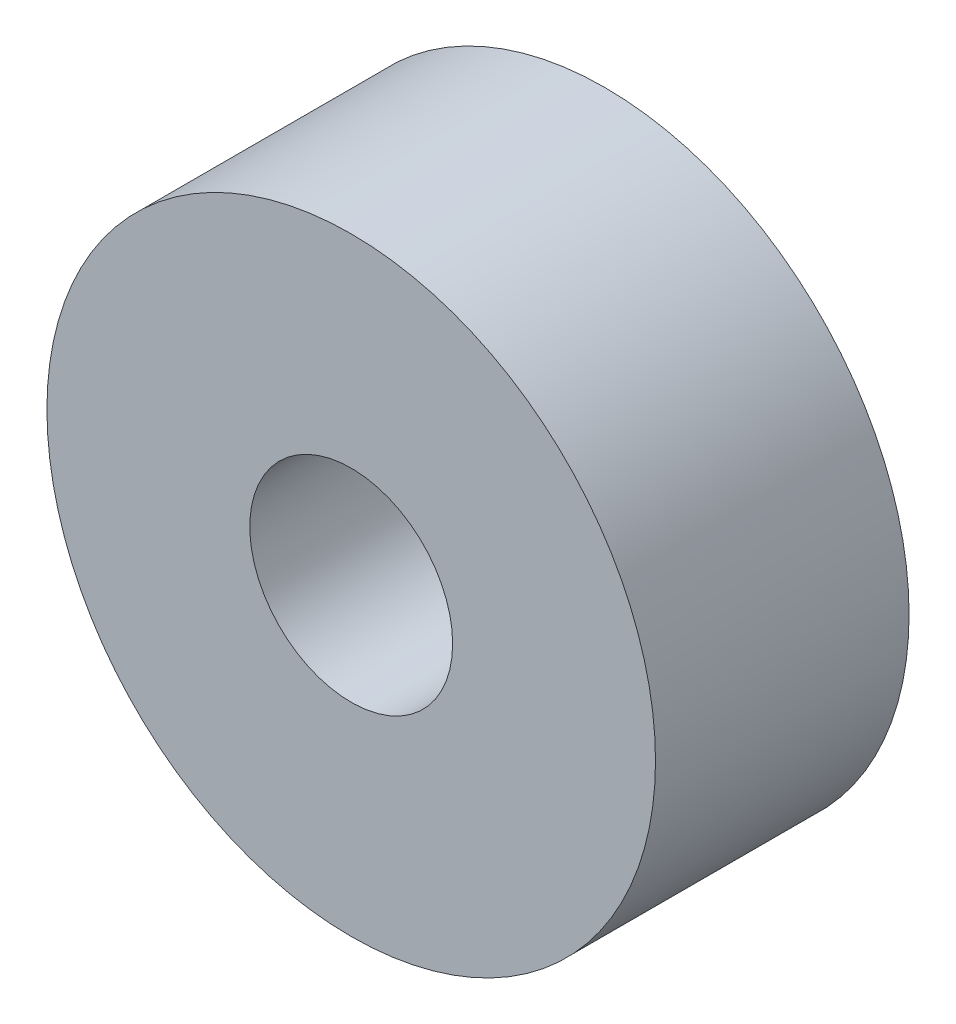
ISO-10303-21;
HEADER;
FILE_DESCRIPTION(('STEP AP214'),'2;1');
FILE_NAME('part.step','',(''),(''),'','','');
FILE_SCHEMA(('AUTOMOTIVE_DESIGN { 1 0 10303 214 1 1 1 1 }'));
ENDSEC;
DATA;
#1=APPLICATION_CONTEXT('core data for automotive mechanical design processes');
#2=APPLICATION_PROTOCOL_DEFINITION('international standard','automotive_design',2000,#1);
#3=PRODUCT_CONTEXT('',#1,'mechanical');
#4=PRODUCT('Part','Part','',(#3));
#5=PRODUCT_RELATED_PRODUCT_CATEGORY('part','',(#4));
#6=PRODUCT_DEFINITION_FORMATION('','',#4);
#7=PRODUCT_DEFINITION_CONTEXT('part definition',#1,'design');
#8=PRODUCT_DEFINITION('design','',#6,#7);
#9=PRODUCT_DEFINITION_SHAPE('','',#8);
#10=(LENGTH_UNIT() NAMED_UNIT(*) SI_UNIT(.MILLI.,.METRE.));
#11=(NAMED_UNIT(*) PLANE_ANGLE_UNIT() SI_UNIT($,.RADIAN.));
#12=(NAMED_UNIT(*) SI_UNIT($,.STERADIAN.) SOLID_ANGLE_UNIT());
#13=UNCERTAINTY_MEASURE_WITH_UNIT(LENGTH_MEASURE(1.E-05),#10,'distance_accuracy_value','');
#14=(GEOMETRIC_REPRESENTATION_CONTEXT(3) GLOBAL_UNCERTAINTY_ASSIGNED_CONTEXT((#13)) GLOBAL_UNIT_ASSIGNED_CONTEXT((#10,
#11,#12)) REPRESENTATION_CONTEXT('',''));
#15=CARTESIAN_POINT('',(0.,0.,0.));
#16=DIRECTION('',(0.,0.,1.));
#17=DIRECTION('',(1.,0.,0.));
#18=AXIS2_PLACEMENT_3D('',#15,#16,#17);
#19=CARTESIAN_POINT('',(0.,0.,3.96875));
#20=DIRECTION('',(0.,0.,-1.));
#21=DIRECTION('',(-1.,0.,0.));
#22=AXIS2_PLACEMENT_3D('',#19,#20,#21);
#23=CYLINDRICAL_SURFACE('',#22,4.7625);
#24=CARTESIAN_POINT('',(0.,0.,3.96875));
#25=DIRECTION('',(0.,0.,1.));
#26=DIRECTION('',(1.,0.,0.));
#27=AXIS2_PLACEMENT_3D('',#24,#25,#26);
#28=CIRCLE('',#27,4.7625);
#29=CARTESIAN_POINT('',(4.7625,0.,3.96875));
#30=VERTEX_POINT('',#29);
#31=EDGE_CURVE('E10',#30,#30,#28,.T.);
#32=ORIENTED_EDGE('',*,*,#31,.F.);
#33=EDGE_LOOP('',(#32));
#34=FACE_BOUND('',#33,.T.);
#35=CARTESIAN_POINT('',(0.,0.,0.));
#36=DIRECTION('',(0.,0.,1.));
#37=DIRECTION('',(1.,0.,0.));
#38=AXIS2_PLACEMENT_3D('',#35,#36,#37);
#39=CIRCLE('',#38,4.7625);
#40=CARTESIAN_POINT('',(4.7625,0.,0.));
#41=VERTEX_POINT('',#40);
#42=EDGE_CURVE('E32',#41,#41,#39,.T.);
#43=ORIENTED_EDGE('',*,*,#42,.T.);
#44=EDGE_LOOP('',(#43));
#45=FACE_BOUND('',#44,.T.);
#46=ADVANCED_FACE('F29',(#34,#45),#23,.T.);
#47=CARTESIAN_POINT('',(0.,0.,3.96875));
#48=DIRECTION('',(0.,0.,1.));
#49=DIRECTION('',(1.,0.,0.));
#50=AXIS2_PLACEMENT_3D('',#47,#48,#49);
#51=PLANE('',#50);
#52=CARTESIAN_POINT('',(0.,0.,3.96875));
#53=DIRECTION('',(0.,0.,1.));
#54=DIRECTION('',(1.,0.,0.));
#55=AXIS2_PLACEMENT_3D('',#52,#53,#54);
#56=CIRCLE('',#55,1.5875);
#57=CARTESIAN_POINT('',(1.5875,0.,3.96875));
#58=VERTEX_POINT('',#57);
#59=EDGE_CURVE('E41',#58,#58,#56,.T.);
#60=ORIENTED_EDGE('',*,*,#59,.F.);
#61=EDGE_LOOP('',(#60));
#62=FACE_BOUND('',#61,.T.);
#63=ORIENTED_EDGE('',*,*,#31,.T.);
#64=EDGE_LOOP('',(#63));
#65=FACE_BOUND('',#64,.T.);
#66=ADVANCED_FACE('F56',(#62,#65),#51,.T.);
#67=CARTESIAN_POINT('',(0.,0.,0.));
#68=DIRECTION('',(0.,0.,1.));
#69=DIRECTION('',(1.,0.,0.));
#70=AXIS2_PLACEMENT_3D('',#67,#68,#69);
#71=PLANE('',#70);
#72=CARTESIAN_POINT('',(0.,0.,0.));
#73=DIRECTION('',(0.,0.,1.));
#74=DIRECTION('',(1.,0.,0.));
#75=AXIS2_PLACEMENT_3D('',#72,#73,#74);
#76=CIRCLE('',#75,1.5875);
#77=CARTESIAN_POINT('',(1.5875,0.,0.));
#78=VERTEX_POINT('',#77);
#79=EDGE_CURVE('E39',#78,#78,#76,.T.);
#80=ORIENTED_EDGE('',*,*,#79,.T.);
#81=EDGE_LOOP('',(#80));
#82=FACE_BOUND('',#81,.T.);
#83=ORIENTED_EDGE('',*,*,#42,.F.);
#84=EDGE_LOOP('',(#83));
#85=FACE_BOUND('',#84,.T.);
#86=ADVANCED_FACE('F47',(#82,#85),#71,.F.);
#87=CARTESIAN_POINT('',(0.,0.,0.));
#88=DIRECTION('',(0.,0.,1.));
#89=DIRECTION('',(1.,0.,0.));
#90=AXIS2_PLACEMENT_3D('',#87,#88,#89);
#91=CYLINDRICAL_SURFACE('',#90,1.5875);
#92=ORIENTED_EDGE('',*,*,#79,.F.);
#93=EDGE_LOOP('',(#92));
#94=FACE_BOUND('',#93,.T.);
#95=ORIENTED_EDGE('',*,*,#59,.T.);
#96=EDGE_LOOP('',(#95));
#97=FACE_BOUND('',#96,.T.);
#98=ADVANCED_FACE('F50',(#94,#97),#91,.F.);
#99=CLOSED_SHELL('',(#46,#66,#86,#98));
#100=MANIFOLD_SOLID_BREP('B2',#99);
#101=ADVANCED_BREP_SHAPE_REPRESENTATION('',(#18,#100),#14);
#102=SHAPE_DEFINITION_REPRESENTATION(#9,#101);
ENDSEC;
END-ISO-10303-21;
